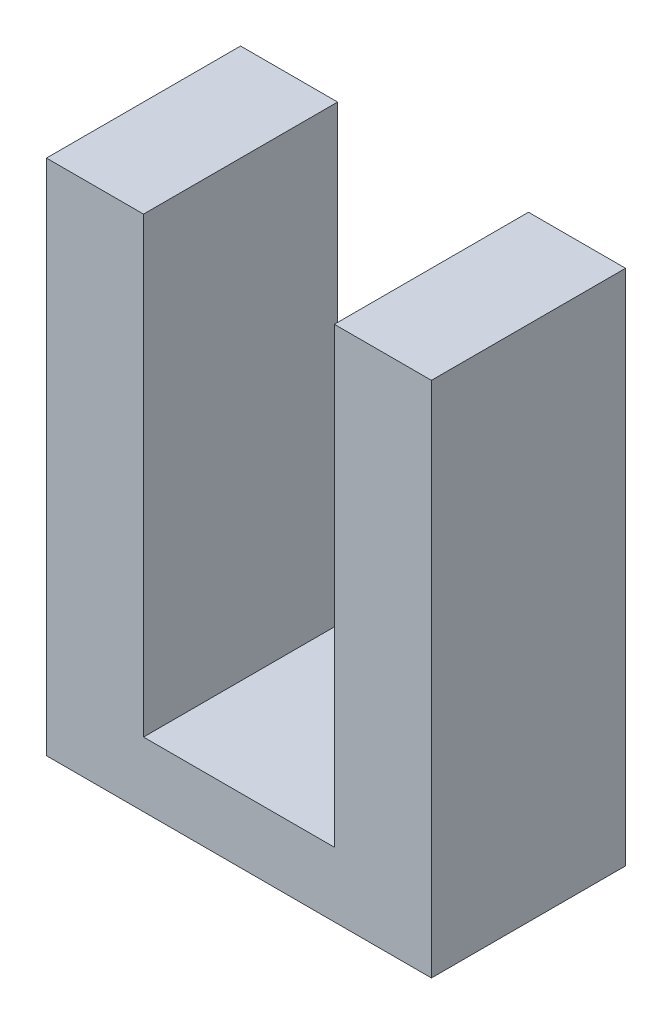
ISO-10303-21;
HEADER;
FILE_DESCRIPTION(('STEP AP214'),'2;1');
FILE_NAME('part.step','',(''),(''),'','','');
FILE_SCHEMA(('AUTOMOTIVE_DESIGN { 1 0 10303 214 1 1 1 1 }'));
ENDSEC;
DATA;
#1=APPLICATION_CONTEXT('core data for automotive mechanical design processes');
#2=APPLICATION_PROTOCOL_DEFINITION('international standard','automotive_design',2000,#1);
#3=PRODUCT_CONTEXT('',#1,'mechanical');
#4=PRODUCT('Part','Part','',(#3));
#5=PRODUCT_RELATED_PRODUCT_CATEGORY('part','',(#4));
#6=PRODUCT_DEFINITION_FORMATION('','',#4);
#7=PRODUCT_DEFINITION_CONTEXT('part definition',#1,'design');
#8=PRODUCT_DEFINITION('design','',#6,#7);
#9=PRODUCT_DEFINITION_SHAPE('','',#8);
#10=(LENGTH_UNIT() NAMED_UNIT(*) SI_UNIT(.MILLI.,.METRE.));
#11=(NAMED_UNIT(*) PLANE_ANGLE_UNIT() SI_UNIT($,.RADIAN.));
#12=(NAMED_UNIT(*) SI_UNIT($,.STERADIAN.) SOLID_ANGLE_UNIT());
#13=UNCERTAINTY_MEASURE_WITH_UNIT(LENGTH_MEASURE(1.E-05),#10,'distance_accuracy_value','');
#14=(GEOMETRIC_REPRESENTATION_CONTEXT(3) GLOBAL_UNCERTAINTY_ASSIGNED_CONTEXT((#13)) GLOBAL_UNIT_ASSIGNED_CONTEXT((#10,
#11,#12)) REPRESENTATION_CONTEXT('',''));
#15=CARTESIAN_POINT('',(0.,0.,0.));
#16=DIRECTION('',(0.,0.,1.));
#17=DIRECTION('',(1.,0.,0.));
#18=AXIS2_PLACEMENT_3D('',#15,#16,#17);
#19=CARTESIAN_POINT('',(-1.475,7.,1.5));
#20=DIRECTION('',(0.,-1.,0.));
#21=DIRECTION('',(0.,0.,-1.));
#22=AXIS2_PLACEMENT_3D('',#19,#20,#21);
#23=PLANE('',#22);
#24=DIRECTION('',(-1.,0.,0.));
#25=VECTOR('',#24,1.);
#26=CARTESIAN_POINT('',(-1.475,7.,-1.5));
#27=LINE('',#26,#25);
#28=CARTESIAN_POINT('',(-1.475,7.,-1.5));
#29=VERTEX_POINT('',#28);
#30=CARTESIAN_POINT('',(-2.975,7.,-1.5));
#31=VERTEX_POINT('',#30);
#32=EDGE_CURVE('E146',#29,#31,#27,.T.);
#33=ORIENTED_EDGE('',*,*,#32,.T.);
#34=DIRECTION('',(0.,0.,-1.));
#35=VECTOR('',#34,1.);
#36=CARTESIAN_POINT('',(-2.975,7.,1.5));
#37=LINE('',#36,#35);
#38=CARTESIAN_POINT('',(-2.975,7.,1.5));
#39=VERTEX_POINT('',#38);
#40=EDGE_CURVE('E11',#39,#31,#37,.T.);
#41=ORIENTED_EDGE('',*,*,#40,.F.);
#42=DIRECTION('',(-1.,0.,0.));
#43=VECTOR('',#42,1.);
#44=CARTESIAN_POINT('',(-1.475,7.,1.5));
#45=LINE('',#44,#43);
#46=CARTESIAN_POINT('',(-1.475,7.,1.5));
#47=VERTEX_POINT('',#46);
#48=EDGE_CURVE('E168',#47,#39,#45,.T.);
#49=ORIENTED_EDGE('',*,*,#48,.F.);
#50=DIRECTION('',(0.,0.,-1.));
#51=VECTOR('',#50,1.);
#52=CARTESIAN_POINT('',(-1.475,7.,1.5));
#53=LINE('',#52,#51);
#54=EDGE_CURVE('E142',#47,#29,#53,.T.);
#55=ORIENTED_EDGE('',*,*,#54,.T.);
#56=EDGE_LOOP('',(#33,#41,#49,#55));
#57=FACE_BOUND('',#56,.T.);
#58=ADVANCED_FACE('F45',(#57),#23,.F.);
#59=CARTESIAN_POINT('',(-2.975,7.,1.5));
#60=DIRECTION('',(1.,0.,0.));
#61=DIRECTION('',(0.,1.,0.));
#62=AXIS2_PLACEMENT_3D('',#59,#60,#61);
#63=PLANE('',#62);
#64=DIRECTION('',(0.,-1.,0.));
#65=VECTOR('',#64,1.);
#66=CARTESIAN_POINT('',(-2.975,7.,-1.5));
#67=LINE('',#66,#65);
#68=CARTESIAN_POINT('',(-2.975,-1.,-1.5));
#69=VERTEX_POINT('',#68);
#70=EDGE_CURVE('E150',#31,#69,#67,.T.);
#71=ORIENTED_EDGE('',*,*,#70,.T.);
#72=DIRECTION('',(0.,0.,-1.));
#73=VECTOR('',#72,1.);
#74=CARTESIAN_POINT('',(-2.975,-1.,1.5));
#75=LINE('',#74,#73);
#76=CARTESIAN_POINT('',(-2.975,-1.,1.5));
#77=VERTEX_POINT('',#76);
#78=EDGE_CURVE('E54',#77,#69,#75,.T.);
#79=ORIENTED_EDGE('',*,*,#78,.F.);
#80=DIRECTION('',(0.,-1.,0.));
#81=VECTOR('',#80,1.);
#82=CARTESIAN_POINT('',(-2.975,7.,1.5));
#83=LINE('',#82,#81);
#84=EDGE_CURVE('E105',#39,#77,#83,.T.);
#85=ORIENTED_EDGE('',*,*,#84,.F.);
#86=ORIENTED_EDGE('',*,*,#40,.T.);
#87=EDGE_LOOP('',(#71,#79,#85,#86));
#88=FACE_BOUND('',#87,.T.);
#89=ADVANCED_FACE('F214',(#88),#63,.F.);
#90=CARTESIAN_POINT('',(-2.975,-1.,1.5));
#91=DIRECTION('',(0.,1.,0.));
#92=DIRECTION('',(0.,0.,1.));
#93=AXIS2_PLACEMENT_3D('',#90,#91,#92);
#94=PLANE('',#93);
#95=DIRECTION('',(1.,0.,0.));
#96=VECTOR('',#95,1.);
#97=CARTESIAN_POINT('',(-2.975,-1.,-1.5));
#98=LINE('',#97,#96);
#99=CARTESIAN_POINT('',(2.975,-1.,-1.5));
#100=VERTEX_POINT('',#99);
#101=EDGE_CURVE('E153',#69,#100,#98,.T.);
#102=ORIENTED_EDGE('',*,*,#101,.T.);
#103=DIRECTION('',(0.,0.,-1.));
#104=VECTOR('',#103,1.);
#105=CARTESIAN_POINT('',(2.975,-1.,1.5));
#106=LINE('',#105,#104);
#107=CARTESIAN_POINT('',(2.975,-1.,1.5));
#108=VERTEX_POINT('',#107);
#109=EDGE_CURVE('E179',#108,#100,#106,.T.);
#110=ORIENTED_EDGE('',*,*,#109,.F.);
#111=DIRECTION('',(1.,0.,0.));
#112=VECTOR('',#111,1.);
#113=CARTESIAN_POINT('',(-2.975,-1.,1.5));
#114=LINE('',#113,#112);
#115=EDGE_CURVE('E189',#77,#108,#114,.T.);
#116=ORIENTED_EDGE('',*,*,#115,.F.);
#117=ORIENTED_EDGE('',*,*,#78,.T.);
#118=EDGE_LOOP('',(#102,#110,#116,#117));
#119=FACE_BOUND('',#118,.T.);
#120=ADVANCED_FACE('F187',(#119),#94,.F.);
#121=CARTESIAN_POINT('',(2.975,-1.,1.5));
#122=DIRECTION('',(-1.,0.,0.));
#123=DIRECTION('',(0.,-1.,0.));
#124=AXIS2_PLACEMENT_3D('',#121,#122,#123);
#125=PLANE('',#124);
#126=DIRECTION('',(0.,1.,0.));
#127=VECTOR('',#126,1.);
#128=CARTESIAN_POINT('',(2.975,-1.,-1.5));
#129=LINE('',#128,#127);
#130=CARTESIAN_POINT('',(2.975,7.,-1.5));
#131=VERTEX_POINT('',#130);
#132=EDGE_CURVE('E156',#100,#131,#129,.T.);
#133=ORIENTED_EDGE('',*,*,#132,.T.);
#134=DIRECTION('',(0.,0.,-1.));
#135=VECTOR('',#134,1.);
#136=CARTESIAN_POINT('',(2.975,7.,1.5));
#137=LINE('',#136,#135);
#138=CARTESIAN_POINT('',(2.975,7.,1.5));
#139=VERTEX_POINT('',#138);
#140=EDGE_CURVE('E175',#139,#131,#137,.T.);
#141=ORIENTED_EDGE('',*,*,#140,.F.);
#142=DIRECTION('',(0.,1.,0.));
#143=VECTOR('',#142,1.);
#144=CARTESIAN_POINT('',(2.975,-1.,1.5));
#145=LINE('',#144,#143);
#146=EDGE_CURVE('E202',#108,#139,#145,.T.);
#147=ORIENTED_EDGE('',*,*,#146,.F.);
#148=ORIENTED_EDGE('',*,*,#109,.T.);
#149=EDGE_LOOP('',(#133,#141,#147,#148));
#150=FACE_BOUND('',#149,.T.);
#151=ADVANCED_FACE('F197',(#150),#125,.F.);
#152=CARTESIAN_POINT('',(2.975,7.,1.5));
#153=DIRECTION('',(0.,-1.,0.));
#154=DIRECTION('',(0.,0.,-1.));
#155=AXIS2_PLACEMENT_3D('',#152,#153,#154);
#156=PLANE('',#155);
#157=DIRECTION('',(-1.,0.,0.));
#158=VECTOR('',#157,1.);
#159=CARTESIAN_POINT('',(2.975,7.,-1.5));
#160=LINE('',#159,#158);
#161=CARTESIAN_POINT('',(1.475,7.,-1.5));
#162=VERTEX_POINT('',#161);
#163=EDGE_CURVE('E159',#131,#162,#160,.T.);
#164=ORIENTED_EDGE('',*,*,#163,.T.);
#165=DIRECTION('',(0.,0.,-1.));
#166=VECTOR('',#165,1.);
#167=CARTESIAN_POINT('',(1.475,7.,1.5));
#168=LINE('',#167,#166);
#169=CARTESIAN_POINT('',(1.475,7.,1.5));
#170=VERTEX_POINT('',#169);
#171=EDGE_CURVE('E135',#170,#162,#168,.T.);
#172=ORIENTED_EDGE('',*,*,#171,.F.);
#173=DIRECTION('',(-1.,0.,0.));
#174=VECTOR('',#173,1.);
#175=CARTESIAN_POINT('',(2.975,7.,1.5));
#176=LINE('',#175,#174);
#177=EDGE_CURVE('E124',#139,#170,#176,.T.);
#178=ORIENTED_EDGE('',*,*,#177,.F.);
#179=ORIENTED_EDGE('',*,*,#140,.T.);
#180=EDGE_LOOP('',(#164,#172,#178,#179));
#181=FACE_BOUND('',#180,.T.);
#182=ADVANCED_FACE('F200',(#181),#156,.F.);
#183=CARTESIAN_POINT('',(1.475,7.,1.5));
#184=DIRECTION('',(1.,0.,0.));
#185=DIRECTION('',(0.,0.,-1.));
#186=AXIS2_PLACEMENT_3D('',#183,#184,#185);
#187=PLANE('',#186);
#188=DIRECTION('',(0.,-1.,0.));
#189=VECTOR('',#188,1.);
#190=CARTESIAN_POINT('',(1.475,7.,-1.5));
#191=LINE('',#190,#189);
#192=CARTESIAN_POINT('',(1.475,0.,-1.5));
#193=VERTEX_POINT('',#192);
#194=EDGE_CURVE('E133',#162,#193,#191,.T.);
#195=ORIENTED_EDGE('',*,*,#194,.T.);
#196=DIRECTION('',(0.,0.,-1.));
#197=VECTOR('',#196,1.);
#198=CARTESIAN_POINT('',(1.475,0.,1.5));
#199=LINE('',#198,#197);
#200=CARTESIAN_POINT('',(1.475,0.,1.5));
#201=VERTEX_POINT('',#200);
#202=EDGE_CURVE('E130',#201,#193,#199,.T.);
#203=ORIENTED_EDGE('',*,*,#202,.F.);
#204=DIRECTION('',(0.,-1.,0.));
#205=VECTOR('',#204,1.);
#206=CARTESIAN_POINT('',(1.475,7.,1.5));
#207=LINE('',#206,#205);
#208=EDGE_CURVE('E118',#170,#201,#207,.T.);
#209=ORIENTED_EDGE('',*,*,#208,.F.);
#210=ORIENTED_EDGE('',*,*,#171,.T.);
#211=EDGE_LOOP('',(#195,#203,#209,#210));
#212=FACE_BOUND('',#211,.T.);
#213=ADVANCED_FACE('F131',(#212),#187,.F.);
#214=CARTESIAN_POINT('',(1.475,0.,1.5));
#215=DIRECTION('',(0.,-1.,0.));
#216=DIRECTION('',(0.,0.,-1.));
#217=AXIS2_PLACEMENT_3D('',#214,#215,#216);
#218=PLANE('',#217);
#219=DIRECTION('',(-1.,0.,0.));
#220=VECTOR('',#219,1.);
#221=CARTESIAN_POINT('',(1.475,0.,-1.5));
#222=LINE('',#221,#220);
#223=CARTESIAN_POINT('',(-1.475,0.,-1.5));
#224=VERTEX_POINT('',#223);
#225=EDGE_CURVE('E91',#193,#224,#222,.T.);
#226=ORIENTED_EDGE('',*,*,#225,.T.);
#227=DIRECTION('',(0.,0.,-1.));
#228=VECTOR('',#227,1.);
#229=CARTESIAN_POINT('',(-1.475,0.,1.5));
#230=LINE('',#229,#228);
#231=CARTESIAN_POINT('',(-1.475,0.,1.5));
#232=VERTEX_POINT('',#231);
#233=EDGE_CURVE('E136',#232,#224,#230,.T.);
#234=ORIENTED_EDGE('',*,*,#233,.F.);
#235=DIRECTION('',(-1.,0.,0.));
#236=VECTOR('',#235,1.);
#237=CARTESIAN_POINT('',(1.475,0.,1.5));
#238=LINE('',#237,#236);
#239=EDGE_CURVE('E122',#201,#232,#238,.T.);
#240=ORIENTED_EDGE('',*,*,#239,.F.);
#241=ORIENTED_EDGE('',*,*,#202,.T.);
#242=EDGE_LOOP('',(#226,#234,#240,#241));
#243=FACE_BOUND('',#242,.T.);
#244=ADVANCED_FACE('F138',(#243),#218,.F.);
#245=CARTESIAN_POINT('',(-1.475,0.,1.5));
#246=DIRECTION('',(-1.,0.,0.));
#247=DIRECTION('',(0.,0.,1.));
#248=AXIS2_PLACEMENT_3D('',#245,#246,#247);
#249=PLANE('',#248);
#250=DIRECTION('',(0.,1.,0.));
#251=VECTOR('',#250,1.);
#252=CARTESIAN_POINT('',(-1.475,0.,-1.5));
#253=LINE('',#252,#251);
#254=EDGE_CURVE('E97',#224,#29,#253,.T.);
#255=ORIENTED_EDGE('',*,*,#254,.T.);
#256=ORIENTED_EDGE('',*,*,#54,.F.);
#257=DIRECTION('',(0.,1.,0.));
#258=VECTOR('',#257,1.);
#259=CARTESIAN_POINT('',(-1.475,0.,1.5));
#260=LINE('',#259,#258);
#261=EDGE_CURVE('E62',#232,#47,#260,.T.);
#262=ORIENTED_EDGE('',*,*,#261,.F.);
#263=ORIENTED_EDGE('',*,*,#233,.T.);
#264=EDGE_LOOP('',(#255,#256,#262,#263));
#265=FACE_BOUND('',#264,.T.);
#266=ADVANCED_FACE('F230',(#265),#249,.F.);
#267=CARTESIAN_POINT('',(0.,0.,1.5));
#268=DIRECTION('',(0.,0.,1.));
#269=DIRECTION('',(1.,0.,0.));
#270=AXIS2_PLACEMENT_3D('',#267,#268,#269);
#271=PLANE('',#270);
#272=ORIENTED_EDGE('',*,*,#48,.T.);
#273=ORIENTED_EDGE('',*,*,#84,.T.);
#274=ORIENTED_EDGE('',*,*,#115,.T.);
#275=ORIENTED_EDGE('',*,*,#146,.T.);
#276=ORIENTED_EDGE('',*,*,#177,.T.);
#277=ORIENTED_EDGE('',*,*,#208,.T.);
#278=ORIENTED_EDGE('',*,*,#239,.T.);
#279=ORIENTED_EDGE('',*,*,#261,.T.);
#280=EDGE_LOOP('',(#272,#273,#274,#275,#276,#277,#278,#279));
#281=FACE_BOUND('',#280,.T.);
#282=ADVANCED_FACE('F120',(#281),#271,.T.);
#283=CARTESIAN_POINT('',(0.,0.,-1.5));
#284=DIRECTION('',(0.,0.,1.));
#285=DIRECTION('',(1.,0.,0.));
#286=AXIS2_PLACEMENT_3D('',#283,#284,#285);
#287=PLANE('',#286);
#288=ORIENTED_EDGE('',*,*,#32,.F.);
#289=ORIENTED_EDGE('',*,*,#254,.F.);
#290=ORIENTED_EDGE('',*,*,#225,.F.);
#291=ORIENTED_EDGE('',*,*,#194,.F.);
#292=ORIENTED_EDGE('',*,*,#163,.F.);
#293=ORIENTED_EDGE('',*,*,#132,.F.);
#294=ORIENTED_EDGE('',*,*,#101,.F.);
#295=ORIENTED_EDGE('',*,*,#70,.F.);
#296=EDGE_LOOP('',(#288,#289,#290,#291,#292,#293,#294,#295));
#297=FACE_BOUND('',#296,.T.);
#298=ADVANCED_FACE('F193',(#297),#287,.F.);
#299=CLOSED_SHELL('',(#58,#89,#120,#151,#182,#213,#244,#266,#282,#298));
#300=MANIFOLD_SOLID_BREP('B2',#299);
#301=ADVANCED_BREP_SHAPE_REPRESENTATION('',(#18,#300),#14);
#302=SHAPE_DEFINITION_REPRESENTATION(#9,#301);
ENDSEC;
END-ISO-10303-21;
